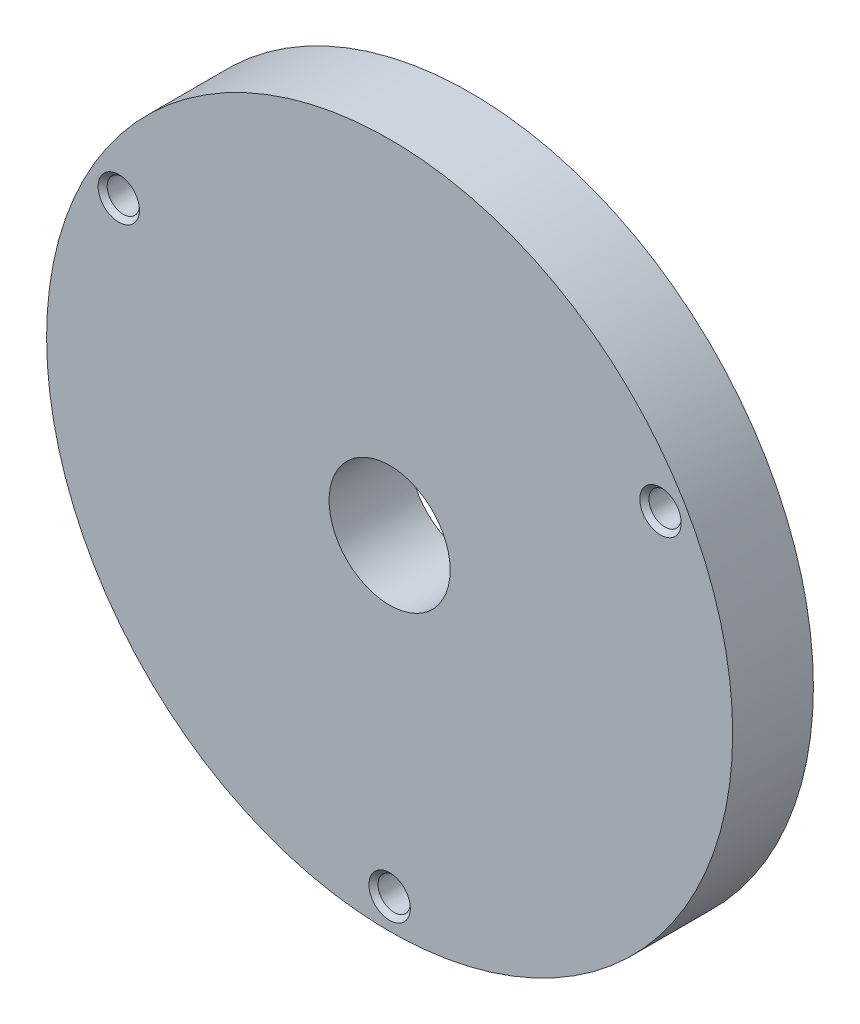
ISO-10303-21;
HEADER;
FILE_DESCRIPTION(('STEP AP214'),'2;1');
FILE_NAME('part.step','',(''),(''),'','','');
FILE_SCHEMA(('AUTOMOTIVE_DESIGN { 1 0 10303 214 1 1 1 1 }'));
ENDSEC;
DATA;
#1=APPLICATION_CONTEXT('core data for automotive mechanical design processes');
#2=APPLICATION_PROTOCOL_DEFINITION('international standard','automotive_design',2000,#1);
#3=PRODUCT_CONTEXT('',#1,'mechanical');
#4=PRODUCT('Part','Part','',(#3));
#5=PRODUCT_RELATED_PRODUCT_CATEGORY('part','',(#4));
#6=PRODUCT_DEFINITION_FORMATION('','',#4);
#7=PRODUCT_DEFINITION_CONTEXT('part definition',#1,'design');
#8=PRODUCT_DEFINITION('design','',#6,#7);
#9=PRODUCT_DEFINITION_SHAPE('','',#8);
#10=(LENGTH_UNIT() NAMED_UNIT(*) SI_UNIT(.MILLI.,.METRE.));
#11=(NAMED_UNIT(*) PLANE_ANGLE_UNIT() SI_UNIT($,.RADIAN.));
#12=(NAMED_UNIT(*) SI_UNIT($,.STERADIAN.) SOLID_ANGLE_UNIT());
#13=UNCERTAINTY_MEASURE_WITH_UNIT(LENGTH_MEASURE(1.E-05),#10,'distance_accuracy_value','');
#14=(GEOMETRIC_REPRESENTATION_CONTEXT(3) GLOBAL_UNCERTAINTY_ASSIGNED_CONTEXT((#13)) GLOBAL_UNIT_ASSIGNED_CONTEXT((#10,
#11,#12)) REPRESENTATION_CONTEXT('',''));
#15=CARTESIAN_POINT('',(0.,0.,0.));
#16=DIRECTION('',(0.,0.,1.));
#17=DIRECTION('',(1.,0.,0.));
#18=AXIS2_PLACEMENT_3D('',#15,#16,#17);
#19=CARTESIAN_POINT('',(0.,0.,-4.));
#20=DIRECTION('',(0.,0.,1.));
#21=DIRECTION('',(1.,0.,0.));
#22=AXIS2_PLACEMENT_3D('',#19,#20,#21);
#23=CYLINDRICAL_SURFACE('',#22,17.);
#24=CARTESIAN_POINT('',(0.,0.,-4.));
#25=DIRECTION('',(0.,0.,1.));
#26=DIRECTION('',(1.,0.,0.));
#27=AXIS2_PLACEMENT_3D('',#24,#25,#26);
#28=CIRCLE('',#27,17.);
#29=CARTESIAN_POINT('',(17.,0.,-4.));
#30=VERTEX_POINT('',#29);
#31=EDGE_CURVE('E10',#30,#30,#28,.T.);
#32=ORIENTED_EDGE('',*,*,#31,.T.);
#33=EDGE_LOOP('',(#32));
#34=FACE_BOUND('',#33,.T.);
#35=CARTESIAN_POINT('',(0.,0.,0.));
#36=DIRECTION('',(0.,0.,1.));
#37=DIRECTION('',(1.,0.,0.));
#38=AXIS2_PLACEMENT_3D('',#35,#36,#37);
#39=CIRCLE('',#38,17.);
#40=CARTESIAN_POINT('',(17.,0.,0.));
#41=VERTEX_POINT('',#40);
#42=EDGE_CURVE('E40',#41,#41,#39,.T.);
#43=ORIENTED_EDGE('',*,*,#42,.F.);
#44=EDGE_LOOP('',(#43));
#45=FACE_BOUND('',#44,.T.);
#46=ADVANCED_FACE('F37',(#34,#45),#23,.T.);
#47=CARTESIAN_POINT('',(0.,0.,-4.));
#48=DIRECTION('',(0.,0.,1.));
#49=DIRECTION('',(1.,0.,0.));
#50=AXIS2_PLACEMENT_3D('',#47,#48,#49);
#51=PLANE('',#50);
#52=CARTESIAN_POINT('',(0.,0.,-4.));
#53=DIRECTION('',(0.,0.,1.));
#54=DIRECTION('',(1.,0.,0.));
#55=AXIS2_PLACEMENT_3D('',#52,#53,#54);
#56=CIRCLE('',#55,3.);
#57=CARTESIAN_POINT('',(3.,0.,-4.));
#58=VERTEX_POINT('',#57);
#59=EDGE_CURVE('E75',#58,#58,#56,.T.);
#60=ORIENTED_EDGE('',*,*,#59,.T.);
#61=EDGE_LOOP('',(#60));
#62=FACE_BOUND('',#61,.T.);
#63=CARTESIAN_POINT('',(-13.4233937586589,7.74999999999987,-4.));
#64=DIRECTION('',(0.,0.,1.));
#65=DIRECTION('',(1.,0.,0.));
#66=AXIS2_PLACEMENT_3D('',#63,#64,#65);
#67=CIRCLE('',#66,0.799999999999986);
#68=CARTESIAN_POINT('',(-12.6233937586589,7.74999999999987,-4.));
#69=VERTEX_POINT('',#68);
#70=EDGE_CURVE('E66',#69,#69,#67,.T.);
#71=ORIENTED_EDGE('',*,*,#70,.T.);
#72=EDGE_LOOP('',(#71));
#73=FACE_BOUND('',#72,.T.);
#74=CARTESIAN_POINT('',(13.4233937586588,7.75000000000006,-4.));
#75=DIRECTION('',(0.,0.,1.));
#76=DIRECTION('',(1.,0.,0.));
#77=AXIS2_PLACEMENT_3D('',#74,#75,#76);
#78=CIRCLE('',#77,0.799999999999986);
#79=CARTESIAN_POINT('',(14.2233937586587,7.75000000000006,-4.));
#80=VERTEX_POINT('',#79);
#81=EDGE_CURVE('E57',#80,#80,#78,.T.);
#82=ORIENTED_EDGE('',*,*,#81,.T.);
#83=EDGE_LOOP('',(#82));
#84=FACE_BOUND('',#83,.T.);
#85=CARTESIAN_POINT('',(0.,-15.5,-4.));
#86=DIRECTION('',(0.,0.,1.));
#87=DIRECTION('',(1.,0.,0.));
#88=AXIS2_PLACEMENT_3D('',#85,#86,#87);
#89=CIRCLE('',#88,0.799999999999987);
#90=CARTESIAN_POINT('',(0.799999999999989,-15.5,-4.));
#91=VERTEX_POINT('',#90);
#92=EDGE_CURVE('E47',#91,#91,#89,.T.);
#93=ORIENTED_EDGE('',*,*,#92,.T.);
#94=EDGE_LOOP('',(#93));
#95=FACE_BOUND('',#94,.T.);
#96=ORIENTED_EDGE('',*,*,#31,.F.);
#97=EDGE_LOOP('',(#96));
#98=FACE_BOUND('',#97,.T.);
#99=ADVANCED_FACE('F82',(#62,#73,#84,#95,#98),#51,.F.);
#100=CARTESIAN_POINT('',(0.,0.,0.));
#101=DIRECTION('',(0.,0.,1.));
#102=DIRECTION('',(1.,0.,0.));
#103=AXIS2_PLACEMENT_3D('',#100,#101,#102);
#104=PLANE('',#103);
#105=CARTESIAN_POINT('',(0.,0.,0.));
#106=DIRECTION('',(0.,0.,1.));
#107=DIRECTION('',(1.,0.,0.));
#108=AXIS2_PLACEMENT_3D('',#105,#106,#107);
#109=CIRCLE('',#108,3.);
#110=CARTESIAN_POINT('',(3.,0.,0.));
#111=VERTEX_POINT('',#110);
#112=EDGE_CURVE('E76',#111,#111,#109,.T.);
#113=ORIENTED_EDGE('',*,*,#112,.F.);
#114=EDGE_LOOP('',(#113));
#115=FACE_BOUND('',#114,.T.);
#116=CARTESIAN_POINT('',(-13.4233937586589,7.74999999999987,0.));
#117=DIRECTION('',(0.,0.,1.));
#118=DIRECTION('',(1.,0.,0.));
#119=AXIS2_PLACEMENT_3D('',#116,#117,#118);
#120=CIRCLE('',#119,1.025);
#121=CARTESIAN_POINT('',(-12.3983937586589,7.74999999999987,0.));
#122=VERTEX_POINT('',#121);
#123=EDGE_CURVE('E72',#122,#122,#120,.T.);
#124=ORIENTED_EDGE('',*,*,#123,.F.);
#125=EDGE_LOOP('',(#124));
#126=FACE_BOUND('',#125,.T.);
#127=CARTESIAN_POINT('',(13.4233937586588,7.75000000000006,0.));
#128=DIRECTION('',(0.,0.,1.));
#129=DIRECTION('',(1.,0.,0.));
#130=AXIS2_PLACEMENT_3D('',#127,#128,#129);
#131=CIRCLE('',#130,1.025);
#132=CARTESIAN_POINT('',(14.4483937586588,7.75000000000006,0.));
#133=VERTEX_POINT('',#132);
#134=EDGE_CURVE('E63',#133,#133,#131,.T.);
#135=ORIENTED_EDGE('',*,*,#134,.F.);
#136=EDGE_LOOP('',(#135));
#137=FACE_BOUND('',#136,.T.);
#138=CARTESIAN_POINT('',(0.,-15.5,0.));
#139=DIRECTION('',(0.,0.,1.));
#140=DIRECTION('',(1.,0.,0.));
#141=AXIS2_PLACEMENT_3D('',#138,#139,#140);
#142=CIRCLE('',#141,1.025);
#143=CARTESIAN_POINT('',(1.025,-15.5,0.));
#144=VERTEX_POINT('',#143);
#145=EDGE_CURVE('E54',#144,#144,#142,.T.);
#146=ORIENTED_EDGE('',*,*,#145,.F.);
#147=EDGE_LOOP('',(#146));
#148=FACE_BOUND('',#147,.T.);
#149=ORIENTED_EDGE('',*,*,#42,.T.);
#150=EDGE_LOOP('',(#149));
#151=FACE_BOUND('',#150,.T.);
#152=ADVANCED_FACE('F92',(#115,#126,#137,#148,#151),#104,.T.);
#153=CARTESIAN_POINT('',(0.,-15.5,0.));
#154=DIRECTION('',(0.,0.,1.));
#155=DIRECTION('',(1.,0.,0.));
#156=AXIS2_PLACEMENT_3D('',#153,#154,#155);
#157=CYLINDRICAL_SURFACE('',#156,0.799999999999993);
#158=ORIENTED_EDGE('',*,*,#92,.F.);
#159=EDGE_LOOP('',(#158));
#160=FACE_BOUND('',#159,.T.);
#161=CARTESIAN_POINT('',(0.,-15.5,-0.225));
#162=DIRECTION('',(0.,0.,1.));
#163=DIRECTION('',(1.,0.,0.));
#164=AXIS2_PLACEMENT_3D('',#161,#162,#163);
#165=CIRCLE('',#164,0.799999999999999);
#166=CARTESIAN_POINT('',(0.800000000000001,-15.5,-0.225));
#167=VERTEX_POINT('',#166);
#168=EDGE_CURVE('E51',#167,#167,#165,.T.);
#169=ORIENTED_EDGE('',*,*,#168,.T.);
#170=EDGE_LOOP('',(#169));
#171=FACE_BOUND('',#170,.T.);
#172=ADVANCED_FACE('F95',(#160,#171),#157,.F.);
#173=CARTESIAN_POINT('',(0.,-15.5,0.));
#174=DIRECTION('',(0.,0.,1.));
#175=DIRECTION('',(1.,0.,0.));
#176=AXIS2_PLACEMENT_3D('',#173,#174,#175);
#177=CONICAL_SURFACE('',#176,1.025,0.785398163397445);
#178=ORIENTED_EDGE('',*,*,#168,.F.);
#179=EDGE_LOOP('',(#178));
#180=FACE_BOUND('',#179,.T.);
#181=ORIENTED_EDGE('',*,*,#145,.T.);
#182=EDGE_LOOP('',(#181));
#183=FACE_BOUND('',#182,.T.);
#184=ADVANCED_FACE('F114',(#180,#183),#177,.F.);
#185=CARTESIAN_POINT('',(13.4233937586588,7.75000000000006,0.));
#186=DIRECTION('',(0.,0.,1.));
#187=DIRECTION('',(1.,0.,0.));
#188=AXIS2_PLACEMENT_3D('',#185,#186,#187);
#189=CYLINDRICAL_SURFACE('',#188,0.799999999999993);
#190=ORIENTED_EDGE('',*,*,#81,.F.);
#191=EDGE_LOOP('',(#190));
#192=FACE_BOUND('',#191,.T.);
#193=CARTESIAN_POINT('',(13.4233937586588,7.75000000000006,-0.225));
#194=DIRECTION('',(0.,0.,1.));
#195=DIRECTION('',(1.,0.,0.));
#196=AXIS2_PLACEMENT_3D('',#193,#194,#195);
#197=CIRCLE('',#196,0.799999999999999);
#198=CARTESIAN_POINT('',(14.2233937586588,7.75000000000006,-0.225));
#199=VERTEX_POINT('',#198);
#200=EDGE_CURVE('E60',#199,#199,#197,.T.);
#201=ORIENTED_EDGE('',*,*,#200,.T.);
#202=EDGE_LOOP('',(#201));
#203=FACE_BOUND('',#202,.T.);
#204=ADVANCED_FACE('F118',(#192,#203),#189,.F.);
#205=CARTESIAN_POINT('',(13.4233937586588,7.75000000000006,0.));
#206=DIRECTION('',(0.,0.,1.));
#207=DIRECTION('',(1.,0.,0.));
#208=AXIS2_PLACEMENT_3D('',#205,#206,#207);
#209=CONICAL_SURFACE('',#208,1.025,0.785398163397446);
#210=ORIENTED_EDGE('',*,*,#200,.F.);
#211=EDGE_LOOP('',(#210));
#212=FACE_BOUND('',#211,.T.);
#213=ORIENTED_EDGE('',*,*,#134,.T.);
#214=EDGE_LOOP('',(#213));
#215=FACE_BOUND('',#214,.T.);
#216=ADVANCED_FACE('F122',(#212,#215),#209,.F.);
#217=CARTESIAN_POINT('',(-13.4233937586589,7.74999999999987,0.));
#218=DIRECTION('',(0.,0.,1.));
#219=DIRECTION('',(1.,0.,0.));
#220=AXIS2_PLACEMENT_3D('',#217,#218,#219);
#221=CYLINDRICAL_SURFACE('',#220,0.799999999999993);
#222=ORIENTED_EDGE('',*,*,#70,.F.);
#223=EDGE_LOOP('',(#222));
#224=FACE_BOUND('',#223,.T.);
#225=CARTESIAN_POINT('',(-13.4233937586589,7.74999999999987,-0.225));
#226=DIRECTION('',(0.,0.,1.));
#227=DIRECTION('',(1.,0.,0.));
#228=AXIS2_PLACEMENT_3D('',#225,#226,#227);
#229=CIRCLE('',#228,0.799999999999999);
#230=CARTESIAN_POINT('',(-12.6233937586589,7.74999999999987,-0.225));
#231=VERTEX_POINT('',#230);
#232=EDGE_CURVE('E69',#231,#231,#229,.T.);
#233=ORIENTED_EDGE('',*,*,#232,.T.);
#234=EDGE_LOOP('',(#233));
#235=FACE_BOUND('',#234,.T.);
#236=ADVANCED_FACE('F126',(#224,#235),#221,.F.);
#237=CARTESIAN_POINT('',(-13.4233937586589,7.74999999999987,0.));
#238=DIRECTION('',(0.,0.,1.));
#239=DIRECTION('',(1.,0.,0.));
#240=AXIS2_PLACEMENT_3D('',#237,#238,#239);
#241=CONICAL_SURFACE('',#240,1.025,0.785398163397446);
#242=ORIENTED_EDGE('',*,*,#232,.F.);
#243=EDGE_LOOP('',(#242));
#244=FACE_BOUND('',#243,.T.);
#245=ORIENTED_EDGE('',*,*,#123,.T.);
#246=EDGE_LOOP('',(#245));
#247=FACE_BOUND('',#246,.T.);
#248=ADVANCED_FACE('F88',(#244,#247),#241,.F.);
#249=CARTESIAN_POINT('',(0.,0.,-4.));
#250=DIRECTION('',(0.,0.,1.));
#251=DIRECTION('',(1.,0.,0.));
#252=AXIS2_PLACEMENT_3D('',#249,#250,#251);
#253=CYLINDRICAL_SURFACE('',#252,3.);
#254=ORIENTED_EDGE('',*,*,#59,.F.);
#255=EDGE_LOOP('',(#254));
#256=FACE_BOUND('',#255,.T.);
#257=ORIENTED_EDGE('',*,*,#112,.T.);
#258=EDGE_LOOP('',(#257));
#259=FACE_BOUND('',#258,.T.);
#260=ADVANCED_FACE('F85',(#256,#259),#253,.F.);
#261=CLOSED_SHELL('',(#46,#99,#152,#172,#184,#204,#216,#236,#248,#260));
#262=MANIFOLD_SOLID_BREP('B2',#261);
#263=ADVANCED_BREP_SHAPE_REPRESENTATION('',(#18,#262),#14);
#264=SHAPE_DEFINITION_REPRESENTATION(#9,#263);
ENDSEC;
END-ISO-10303-21;
